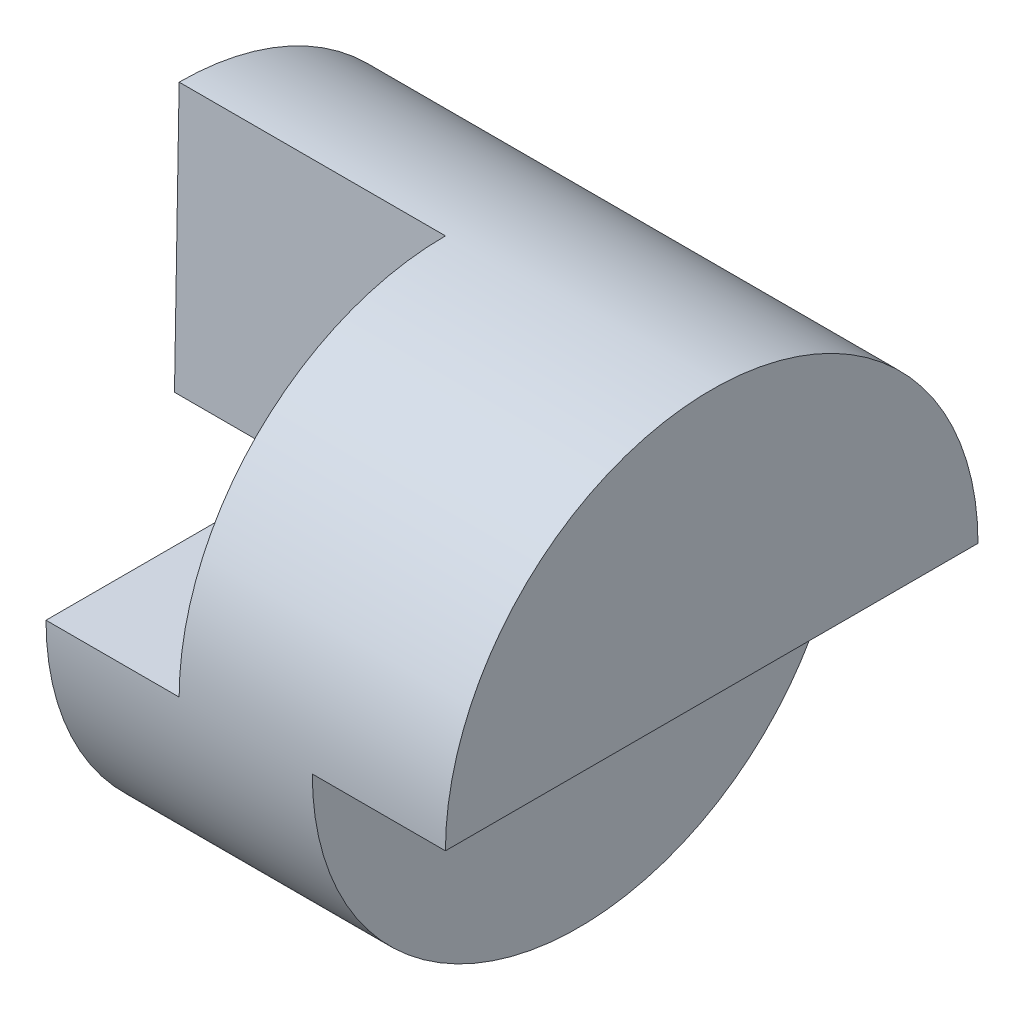
ISO-10303-21;
HEADER;
FILE_DESCRIPTION(('STEP AP214'),'2;1');
FILE_NAME('part.step','',(''),(''),'','','');
FILE_SCHEMA(('AUTOMOTIVE_DESIGN { 1 0 10303 214 1 1 1 1 }'));
ENDSEC;
DATA;
#1=APPLICATION_CONTEXT('core data for automotive mechanical design processes');
#2=APPLICATION_PROTOCOL_DEFINITION('international standard','automotive_design',2000,#1);
#3=PRODUCT_CONTEXT('',#1,'mechanical');
#4=PRODUCT('Part','Part','',(#3));
#5=PRODUCT_RELATED_PRODUCT_CATEGORY('part','',(#4));
#6=PRODUCT_DEFINITION_FORMATION('','',#4);
#7=PRODUCT_DEFINITION_CONTEXT('part definition',#1,'design');
#8=PRODUCT_DEFINITION('design','',#6,#7);
#9=PRODUCT_DEFINITION_SHAPE('','',#8);
#10=(LENGTH_UNIT() NAMED_UNIT(*) SI_UNIT(.MILLI.,.METRE.));
#11=(NAMED_UNIT(*) PLANE_ANGLE_UNIT() SI_UNIT($,.RADIAN.));
#12=(NAMED_UNIT(*) SI_UNIT($,.STERADIAN.) SOLID_ANGLE_UNIT());
#13=UNCERTAINTY_MEASURE_WITH_UNIT(LENGTH_MEASURE(1.E-05),#10,'distance_accuracy_value','');
#14=(GEOMETRIC_REPRESENTATION_CONTEXT(3) GLOBAL_UNCERTAINTY_ASSIGNED_CONTEXT((#13)) GLOBAL_UNIT_ASSIGNED_CONTEXT((#10,
#11,#12)) REPRESENTATION_CONTEXT('',''));
#15=CARTESIAN_POINT('',(0.,0.,0.));
#16=DIRECTION('',(0.,0.,1.));
#17=DIRECTION('',(1.,0.,0.));
#18=AXIS2_PLACEMENT_3D('',#15,#16,#17);
#19=CARTESIAN_POINT('',(0.,0.,0.));
#20=DIRECTION('',(-1.,0.,0.));
#21=DIRECTION('',(0.,0.,1.));
#22=AXIS2_PLACEMENT_3D('',#19,#20,#21);
#23=CYLINDRICAL_SURFACE('',#22,2.);
#24=DIRECTION('',(-1.,0.,0.));
#25=VECTOR('',#24,1.);
#26=CARTESIAN_POINT('',(0.,0.,-2.));
#27=LINE('',#26,#25);
#28=CARTESIAN_POINT('',(3.,0.,-2.));
#29=VERTEX_POINT('',#28);
#30=CARTESIAN_POINT('',(4.,0.,-2.));
#31=VERTEX_POINT('',#30);
#32=EDGE_CURVE('E47',#29,#31,#27,.F.);
#33=ORIENTED_EDGE('',*,*,#32,.F.);
#34=CARTESIAN_POINT('',(3.,0.,0.));
#35=DIRECTION('',(-1.,0.,0.));
#36=DIRECTION('',(0.,0.,1.));
#37=AXIS2_PLACEMENT_3D('',#34,#35,#36);
#38=CIRCLE('',#37,2.);
#39=CARTESIAN_POINT('',(3.,0.,2.));
#40=VERTEX_POINT('',#39);
#41=EDGE_CURVE('E11',#40,#29,#38,.F.);
#42=ORIENTED_EDGE('',*,*,#41,.F.);
#43=DIRECTION('',(-1.,0.,0.));
#44=VECTOR('',#43,1.);
#45=CARTESIAN_POINT('',(0.,0.,2.));
#46=LINE('',#45,#44);
#47=CARTESIAN_POINT('',(4.,0.,2.));
#48=VERTEX_POINT('',#47);
#49=EDGE_CURVE('E88',#48,#40,#46,.T.);
#50=ORIENTED_EDGE('',*,*,#49,.F.);
#51=CARTESIAN_POINT('',(4.,0.,0.));
#52=DIRECTION('',(-1.,0.,0.));
#53=DIRECTION('',(0.,0.,1.));
#54=AXIS2_PLACEMENT_3D('',#51,#52,#53);
#55=CIRCLE('',#54,2.);
#56=EDGE_CURVE('E97',#48,#31,#55,.T.);
#57=ORIENTED_EDGE('',*,*,#56,.T.);
#58=EDGE_LOOP('',(#33,#42,#50,#57));
#59=FACE_BOUND('',#58,.T.);
#60=DIRECTION('',(-1.,0.,0.));
#61=VECTOR('',#60,1.);
#62=CARTESIAN_POINT('',(0.,0.,-2.));
#63=LINE('',#62,#61);
#64=CARTESIAN_POINT('',(0.,0.,-2.));
#65=VERTEX_POINT('',#64);
#66=CARTESIAN_POINT('',(1.,0.,-2.));
#67=VERTEX_POINT('',#66);
#68=EDGE_CURVE('E137',#65,#67,#63,.F.);
#69=ORIENTED_EDGE('',*,*,#68,.F.);
#70=CARTESIAN_POINT('',(0.,0.,0.));
#71=DIRECTION('',(-1.,0.,0.));
#72=DIRECTION('',(0.,0.,1.));
#73=AXIS2_PLACEMENT_3D('',#70,#71,#72);
#74=CIRCLE('',#73,2.);
#75=CARTESIAN_POINT('',(0.,2.,0.));
#76=VERTEX_POINT('',#75);
#77=EDGE_CURVE('E101',#76,#65,#74,.T.);
#78=ORIENTED_EDGE('',*,*,#77,.F.);
#79=DIRECTION('',(1.,0.,0.));
#80=VECTOR('',#79,1.);
#81=CARTESIAN_POINT('',(0.5,2.,0.));
#82=LINE('',#81,#80);
#83=CARTESIAN_POINT('',(2.,2.,0.));
#84=VERTEX_POINT('',#83);
#85=EDGE_CURVE('E121',#76,#84,#82,.T.);
#86=ORIENTED_EDGE('',*,*,#85,.T.);
#87=CARTESIAN_POINT('',(2.,0.,0.));
#88=DIRECTION('',(1.,0.,0.));
#89=DIRECTION('',(0.,0.,-1.));
#90=AXIS2_PLACEMENT_3D('',#87,#88,#89);
#91=CIRCLE('',#90,2.);
#92=CARTESIAN_POINT('',(2.,0.,2.));
#93=VERTEX_POINT('',#92);
#94=EDGE_CURVE('E93',#93,#84,#91,.F.);
#95=ORIENTED_EDGE('',*,*,#94,.F.);
#96=DIRECTION('',(-1.,0.,0.));
#97=VECTOR('',#96,1.);
#98=CARTESIAN_POINT('',(0.,0.,2.));
#99=LINE('',#98,#97);
#100=CARTESIAN_POINT('',(1.,0.,2.));
#101=VERTEX_POINT('',#100);
#102=EDGE_CURVE('E102',#101,#93,#99,.F.);
#103=ORIENTED_EDGE('',*,*,#102,.F.);
#104=CARTESIAN_POINT('',(1.,0.,0.));
#105=DIRECTION('',(1.,0.,0.));
#106=DIRECTION('',(0.,0.,-1.));
#107=AXIS2_PLACEMENT_3D('',#104,#105,#106);
#108=CIRCLE('',#107,2.);
#109=EDGE_CURVE('E135',#67,#101,#108,.F.);
#110=ORIENTED_EDGE('',*,*,#109,.F.);
#111=EDGE_LOOP('',(#69,#78,#86,#95,#103,#110));
#112=FACE_BOUND('',#111,.T.);
#113=ADVANCED_FACE('F33',(#59,#112),#23,.T.);
#114=CARTESIAN_POINT('',(4.,0.,0.));
#115=DIRECTION('',(-1.,0.,0.));
#116=DIRECTION('',(0.,0.,1.));
#117=AXIS2_PLACEMENT_3D('',#114,#115,#116);
#118=PLANE('',#117);
#119=ORIENTED_EDGE('',*,*,#56,.F.);
#120=DIRECTION('',(0.,0.,-1.));
#121=VECTOR('',#120,1.);
#122=CARTESIAN_POINT('',(4.,0.,0.));
#123=LINE('',#122,#121);
#124=EDGE_CURVE('E40',#48,#31,#123,.T.);
#125=ORIENTED_EDGE('',*,*,#124,.T.);
#126=EDGE_LOOP('',(#119,#125));
#127=FACE_BOUND('',#126,.T.);
#128=ADVANCED_FACE('F100',(#127),#118,.F.);
#129=CARTESIAN_POINT('',(0.,-2.,0.));
#130=DIRECTION('',(1.,0.,0.));
#131=DIRECTION('',(0.,0.,-1.));
#132=AXIS2_PLACEMENT_3D('',#129,#130,#131);
#133=PLANE('',#132);
#134=ORIENTED_EDGE('',*,*,#77,.T.);
#135=DIRECTION('',(0.,0.,-1.));
#136=VECTOR('',#135,1.);
#137=CARTESIAN_POINT('',(0.,0.,2.));
#138=LINE('',#137,#136);
#139=CARTESIAN_POINT('',(0.,0.,0.034977088325542));
#140=VERTEX_POINT('',#139);
#141=EDGE_CURVE('E139',#140,#65,#138,.T.);
#142=ORIENTED_EDGE('',*,*,#141,.F.);
#143=DIRECTION('',(0.,-0.99984711048149,0.017485870347671));
#144=VECTOR('',#143,1.);
#145=CARTESIAN_POINT('',(0.,0.,0.0349770883255419));
#146=LINE('',#145,#144);
#147=EDGE_CURVE('E133',#76,#140,#146,.T.);
#148=ORIENTED_EDGE('',*,*,#147,.F.);
#149=EDGE_LOOP('',(#134,#142,#148));
#150=FACE_BOUND('',#149,.T.);
#151=ADVANCED_FACE('F161',(#150),#133,.F.);
#152=CARTESIAN_POINT('',(0.,0.,-11.));
#153=DIRECTION('',(0.,-1.,0.));
#154=DIRECTION('',(1.,0.,0.));
#155=AXIS2_PLACEMENT_3D('',#152,#153,#154);
#156=PLANE('',#155);
#157=DIRECTION('',(1.,0.,0.));
#158=VECTOR('',#157,1.);
#159=CARTESIAN_POINT('',(0.,0.,0.0349770883255419));
#160=LINE('',#159,#158);
#161=CARTESIAN_POINT('',(1.,0.,0.0349770883255419));
#162=VERTEX_POINT('',#161);
#163=CARTESIAN_POINT('',(2.,0.,0.0349770883255419));
#164=VERTEX_POINT('',#163);
#165=EDGE_CURVE('E132',#162,#164,#160,.T.);
#166=ORIENTED_EDGE('',*,*,#165,.F.);
#167=DIRECTION('',(0.,0.,-1.));
#168=VECTOR('',#167,1.);
#169=CARTESIAN_POINT('',(1.,0.,2.));
#170=LINE('',#169,#168);
#171=EDGE_CURVE('E55',#101,#162,#170,.T.);
#172=ORIENTED_EDGE('',*,*,#171,.F.);
#173=ORIENTED_EDGE('',*,*,#102,.T.);
#174=DIRECTION('',(0.,0.,-1.));
#175=VECTOR('',#174,1.);
#176=CARTESIAN_POINT('',(2.,0.,10.));
#177=LINE('',#176,#175);
#178=EDGE_CURVE('E106',#93,#164,#177,.T.);
#179=ORIENTED_EDGE('',*,*,#178,.T.);
#180=EDGE_LOOP('',(#166,#172,#173,#179));
#181=FACE_BOUND('',#180,.T.);
#182=ADVANCED_FACE('F166',(#181),#156,.F.);
#183=CARTESIAN_POINT('',(2.,0.,10.));
#184=DIRECTION('',(1.,0.,0.));
#185=DIRECTION('',(0.,0.,-1.));
#186=AXIS2_PLACEMENT_3D('',#183,#184,#185);
#187=PLANE('',#186);
#188=ORIENTED_EDGE('',*,*,#94,.T.);
#189=DIRECTION('',(0.,-0.99984711048149,0.017485870347671));
#190=VECTOR('',#189,1.);
#191=CARTESIAN_POINT('',(2.,-0.174220458090097,0.0380239505009088));
#192=LINE('',#191,#190);
#193=EDGE_CURVE('E117',#84,#164,#192,.T.);
#194=ORIENTED_EDGE('',*,*,#193,.T.);
#195=ORIENTED_EDGE('',*,*,#178,.F.);
#196=EDGE_LOOP('',(#188,#194,#195));
#197=FACE_BOUND('',#196,.T.);
#198=ADVANCED_FACE('F116',(#197),#187,.F.);
#199=CARTESIAN_POINT('',(0.,0.,0.0349770883255419));
#200=DIRECTION('',(0.,0.017485870347671,0.99984711048149));
#201=DIRECTION('',(0.,-0.99984711048149,0.017485870347671));
#202=AXIS2_PLACEMENT_3D('',#199,#200,#201);
#203=PLANE('',#202);
#204=ORIENTED_EDGE('',*,*,#193,.F.);
#205=ORIENTED_EDGE('',*,*,#85,.F.);
#206=ORIENTED_EDGE('',*,*,#147,.T.);
#207=EDGE_CURVE('E127',#140,#162,#160,.T.);
#208=ORIENTED_EDGE('',*,*,#207,.T.);
#209=ORIENTED_EDGE('',*,*,#165,.T.);
#210=EDGE_LOOP('',(#204,#205,#206,#208,#209));
#211=FACE_BOUND('',#210,.T.);
#212=ADVANCED_FACE('F174',(#211),#203,.T.);
#213=CARTESIAN_POINT('',(1.,0.,2.));
#214=DIRECTION('',(0.,1.,0.));
#215=DIRECTION('',(0.,0.,1.));
#216=AXIS2_PLACEMENT_3D('',#213,#214,#215);
#217=PLANE('',#216);
#218=ORIENTED_EDGE('',*,*,#68,.T.);
#219=EDGE_CURVE('E141',#162,#67,#170,.T.);
#220=ORIENTED_EDGE('',*,*,#219,.F.);
#221=ORIENTED_EDGE('',*,*,#207,.F.);
#222=ORIENTED_EDGE('',*,*,#141,.T.);
#223=EDGE_LOOP('',(#218,#220,#221,#222));
#224=FACE_BOUND('',#223,.T.);
#225=ADVANCED_FACE('F154',(#224),#217,.F.);
#226=CARTESIAN_POINT('',(1.,0.,0.));
#227=DIRECTION('',(1.,0.,0.));
#228=DIRECTION('',(0.,0.,-1.));
#229=AXIS2_PLACEMENT_3D('',#226,#227,#228);
#230=PLANE('',#229);
#231=ORIENTED_EDGE('',*,*,#109,.T.);
#232=ORIENTED_EDGE('',*,*,#171,.T.);
#233=ORIENTED_EDGE('',*,*,#219,.T.);
#234=EDGE_LOOP('',(#231,#232,#233));
#235=FACE_BOUND('',#234,.T.);
#236=ADVANCED_FACE('F147',(#235),#230,.F.);
#237=CARTESIAN_POINT('',(3.,-2.,-5.));
#238=DIRECTION('',(-1.,0.,0.));
#239=DIRECTION('',(0.,0.,1.));
#240=AXIS2_PLACEMENT_3D('',#237,#238,#239);
#241=PLANE('',#240);
#242=ORIENTED_EDGE('',*,*,#41,.T.);
#243=DIRECTION('',(0.,0.,1.));
#244=VECTOR('',#243,1.);
#245=CARTESIAN_POINT('',(3.,0.,-5.));
#246=LINE('',#245,#244);
#247=EDGE_CURVE('E98',#29,#40,#246,.T.);
#248=ORIENTED_EDGE('',*,*,#247,.T.);
#249=EDGE_LOOP('',(#242,#248));
#250=FACE_BOUND('',#249,.T.);
#251=ADVANCED_FACE('F145',(#250),#241,.F.);
#252=CARTESIAN_POINT('',(4.,0.,-5.));
#253=DIRECTION('',(0.,1.,0.));
#254=DIRECTION('',(-1.,0.,0.));
#255=AXIS2_PLACEMENT_3D('',#252,#253,#254);
#256=PLANE('',#255);
#257=ORIENTED_EDGE('',*,*,#32,.T.);
#258=ORIENTED_EDGE('',*,*,#124,.F.);
#259=ORIENTED_EDGE('',*,*,#49,.T.);
#260=ORIENTED_EDGE('',*,*,#247,.F.);
#261=EDGE_LOOP('',(#257,#258,#259,#260));
#262=FACE_BOUND('',#261,.T.);
#263=ADVANCED_FACE('F87',(#262),#256,.F.);
#264=CLOSED_SHELL('',(#113,#128,#151,#182,#198,#212,#225,#236,#251,#263));
#265=MANIFOLD_SOLID_BREP('B2',#264);
#266=ADVANCED_BREP_SHAPE_REPRESENTATION('',(#18,#265),#14);
#267=SHAPE_DEFINITION_REPRESENTATION(#9,#266);
ENDSEC;
END-ISO-10303-21;
